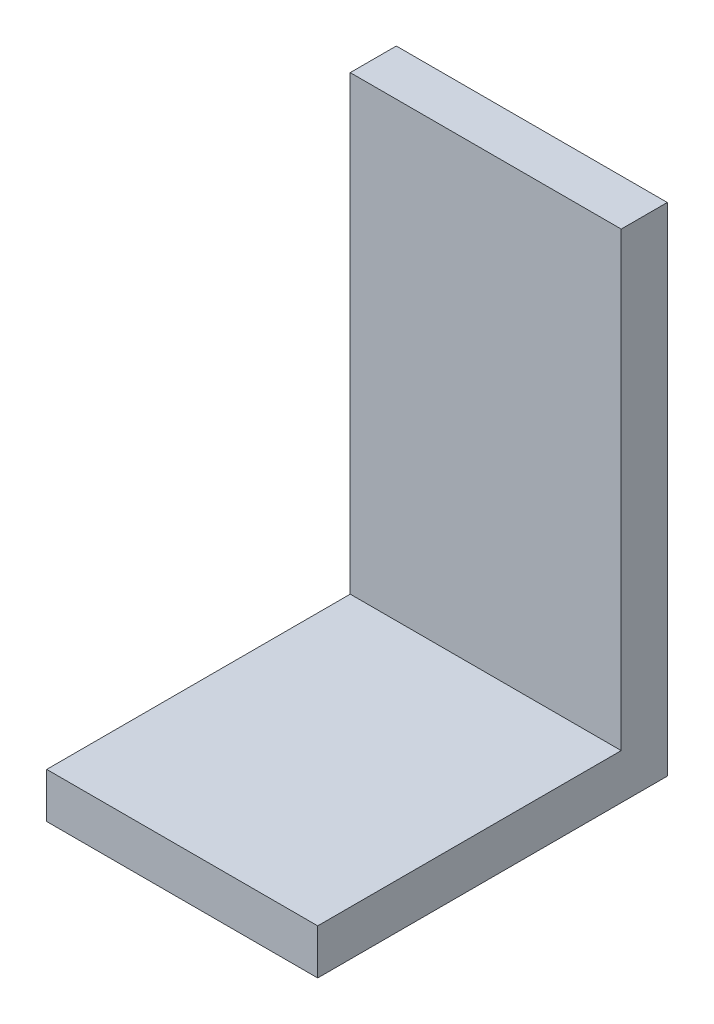
ISO-10303-21;
HEADER;
FILE_DESCRIPTION(('STEP AP214'),'2;1');
FILE_NAME('part.step','',(''),(''),'','','');
FILE_SCHEMA(('AUTOMOTIVE_DESIGN { 1 0 10303 214 1 1 1 1 }'));
ENDSEC;
DATA;
#1=APPLICATION_CONTEXT('core data for automotive mechanical design processes');
#2=APPLICATION_PROTOCOL_DEFINITION('international standard','automotive_design',2000,#1);
#3=PRODUCT_CONTEXT('',#1,'mechanical');
#4=PRODUCT('Part','Part','',(#3));
#5=PRODUCT_RELATED_PRODUCT_CATEGORY('part','',(#4));
#6=PRODUCT_DEFINITION_FORMATION('','',#4);
#7=PRODUCT_DEFINITION_CONTEXT('part definition',#1,'design');
#8=PRODUCT_DEFINITION('design','',#6,#7);
#9=PRODUCT_DEFINITION_SHAPE('','',#8);
#10=(LENGTH_UNIT() NAMED_UNIT(*) SI_UNIT(.MILLI.,.METRE.));
#11=(NAMED_UNIT(*) PLANE_ANGLE_UNIT() SI_UNIT($,.RADIAN.));
#12=(NAMED_UNIT(*) SI_UNIT($,.STERADIAN.) SOLID_ANGLE_UNIT());
#13=UNCERTAINTY_MEASURE_WITH_UNIT(LENGTH_MEASURE(1.E-05),#10,'distance_accuracy_value','');
#14=(GEOMETRIC_REPRESENTATION_CONTEXT(3) GLOBAL_UNCERTAINTY_ASSIGNED_CONTEXT((#13)) GLOBAL_UNIT_ASSIGNED_CONTEXT((#10,
#11,#12)) REPRESENTATION_CONTEXT('',''));
#15=CARTESIAN_POINT('',(0.,0.,0.));
#16=DIRECTION('',(0.,0.,1.));
#17=DIRECTION('',(1.,0.,0.));
#18=AXIS2_PLACEMENT_3D('',#15,#16,#17);
#19=CARTESIAN_POINT('',(3.9,-4.55,0.));
#20=DIRECTION('',(1.,0.,0.));
#21=DIRECTION('',(0.,0.,1.));
#22=AXIS2_PLACEMENT_3D('',#19,#20,#21);
#23=PLANE('',#22);
#24=DIRECTION('',(0.,-1.,0.));
#25=VECTOR('',#24,1.);
#26=CARTESIAN_POINT('',(3.9,-4.,0.));
#27=LINE('',#26,#25);
#28=CARTESIAN_POINT('',(3.9,-4.,0.));
#29=VERTEX_POINT('',#28);
#30=CARTESIAN_POINT('',(3.9,-4.55,0.));
#31=VERTEX_POINT('',#30);
#32=EDGE_CURVE('E11',#29,#31,#27,.T.);
#33=ORIENTED_EDGE('',*,*,#32,.F.);
#34=DIRECTION('',(0.,0.,-1.));
#35=VECTOR('',#34,1.);
#36=CARTESIAN_POINT('',(3.9,-4.,0.051));
#37=LINE('',#36,#35);
#38=CARTESIAN_POINT('',(3.9,-4.,0.051));
#39=VERTEX_POINT('',#38);
#40=EDGE_CURVE('E24',#39,#29,#37,.T.);
#41=ORIENTED_EDGE('',*,*,#40,.F.);
#42=DIRECTION('',(0.,1.,0.));
#43=VECTOR('',#42,1.);
#44=CARTESIAN_POINT('',(3.9,-4.5,0.051));
#45=LINE('',#44,#43);
#46=CARTESIAN_POINT('',(3.9,-4.5,0.051));
#47=VERTEX_POINT('',#46);
#48=EDGE_CURVE('E87',#47,#39,#45,.T.);
#49=ORIENTED_EDGE('',*,*,#48,.F.);
#50=DIRECTION('',(0.,0.,-1.));
#51=VECTOR('',#50,1.);
#52=CARTESIAN_POINT('',(3.9,-4.5,0.387));
#53=LINE('',#52,#51);
#54=CARTESIAN_POINT('',(3.9,-4.5,0.387));
#55=VERTEX_POINT('',#54);
#56=EDGE_CURVE('E114',#55,#47,#53,.T.);
#57=ORIENTED_EDGE('',*,*,#56,.F.);
#58=DIRECTION('',(0.,1.,0.));
#59=VECTOR('',#58,1.);
#60=CARTESIAN_POINT('',(3.9,-4.55,0.387));
#61=LINE('',#60,#59);
#62=CARTESIAN_POINT('',(3.9,-4.55,0.387));
#63=VERTEX_POINT('',#62);
#64=EDGE_CURVE('E111',#63,#55,#61,.T.);
#65=ORIENTED_EDGE('',*,*,#64,.F.);
#66=DIRECTION('',(0.,0.,1.));
#67=VECTOR('',#66,1.);
#68=CARTESIAN_POINT('',(3.9,-4.55,0.));
#69=LINE('',#68,#67);
#70=EDGE_CURVE('E108',#31,#63,#69,.T.);
#71=ORIENTED_EDGE('',*,*,#70,.F.);
#72=EDGE_LOOP('',(#33,#41,#49,#57,#65,#71));
#73=FACE_BOUND('',#72,.T.);
#74=ADVANCED_FACE('F17',(#73),#23,.T.);
#75=CARTESIAN_POINT('',(3.6,-4.,0.));
#76=DIRECTION('',(-1.,0.,0.));
#77=DIRECTION('',(0.,0.,1.));
#78=AXIS2_PLACEMENT_3D('',#75,#76,#77);
#79=PLANE('',#78);
#80=DIRECTION('',(0.,1.,0.));
#81=VECTOR('',#80,1.);
#82=CARTESIAN_POINT('',(3.6,-4.55,0.));
#83=LINE('',#82,#81);
#84=CARTESIAN_POINT('',(3.6,-4.55,0.));
#85=VERTEX_POINT('',#84);
#86=CARTESIAN_POINT('',(3.6,-4.,0.));
#87=VERTEX_POINT('',#86);
#88=EDGE_CURVE('E106',#85,#87,#83,.T.);
#89=ORIENTED_EDGE('',*,*,#88,.F.);
#90=DIRECTION('',(0.,0.,-1.));
#91=VECTOR('',#90,1.);
#92=CARTESIAN_POINT('',(3.6,-4.55,0.387));
#93=LINE('',#92,#91);
#94=CARTESIAN_POINT('',(3.6,-4.55,0.387));
#95=VERTEX_POINT('',#94);
#96=EDGE_CURVE('E103',#95,#85,#93,.T.);
#97=ORIENTED_EDGE('',*,*,#96,.F.);
#98=DIRECTION('',(0.,-1.,0.));
#99=VECTOR('',#98,1.);
#100=CARTESIAN_POINT('',(3.6,-4.5,0.387));
#101=LINE('',#100,#99);
#102=CARTESIAN_POINT('',(3.6,-4.5,0.387));
#103=VERTEX_POINT('',#102);
#104=EDGE_CURVE('E100',#103,#95,#101,.T.);
#105=ORIENTED_EDGE('',*,*,#104,.F.);
#106=DIRECTION('',(0.,0.,1.));
#107=VECTOR('',#106,1.);
#108=CARTESIAN_POINT('',(3.6,-4.5,0.051));
#109=LINE('',#108,#107);
#110=CARTESIAN_POINT('',(3.6,-4.5,0.051));
#111=VERTEX_POINT('',#110);
#112=EDGE_CURVE('E72',#111,#103,#109,.T.);
#113=ORIENTED_EDGE('',*,*,#112,.F.);
#114=DIRECTION('',(0.,-1.,0.));
#115=VECTOR('',#114,1.);
#116=CARTESIAN_POINT('',(3.6,-4.,0.051));
#117=LINE('',#116,#115);
#118=CARTESIAN_POINT('',(3.6,-4.,0.051));
#119=VERTEX_POINT('',#118);
#120=EDGE_CURVE('E66',#119,#111,#117,.T.);
#121=ORIENTED_EDGE('',*,*,#120,.F.);
#122=DIRECTION('',(0.,0.,1.));
#123=VECTOR('',#122,1.);
#124=CARTESIAN_POINT('',(3.6,-4.,0.));
#125=LINE('',#124,#123);
#126=EDGE_CURVE('E69',#87,#119,#125,.T.);
#127=ORIENTED_EDGE('',*,*,#126,.F.);
#128=EDGE_LOOP('',(#89,#97,#105,#113,#121,#127));
#129=FACE_BOUND('',#128,.T.);
#130=ADVANCED_FACE('F68',(#129),#79,.T.);
#131=CARTESIAN_POINT('',(3.9,-4.55,0.387));
#132=DIRECTION('',(0.,0.,1.));
#133=DIRECTION('',(0.,1.,0.));
#134=AXIS2_PLACEMENT_3D('',#131,#132,#133);
#135=PLANE('',#134);
#136=ORIENTED_EDGE('',*,*,#64,.T.);
#137=DIRECTION('',(1.,0.,0.));
#138=VECTOR('',#137,1.);
#139=CARTESIAN_POINT('',(3.6,-4.5,0.387));
#140=LINE('',#139,#138);
#141=EDGE_CURVE('E83',#103,#55,#140,.T.);
#142=ORIENTED_EDGE('',*,*,#141,.F.);
#143=ORIENTED_EDGE('',*,*,#104,.T.);
#144=DIRECTION('',(-1.,0.,0.));
#145=VECTOR('',#144,1.);
#146=CARTESIAN_POINT('',(3.9,-4.55,0.387));
#147=LINE('',#146,#145);
#148=EDGE_CURVE('E88',#63,#95,#147,.T.);
#149=ORIENTED_EDGE('',*,*,#148,.F.);
#150=EDGE_LOOP('',(#136,#142,#143,#149));
#151=FACE_BOUND('',#150,.T.);
#152=ADVANCED_FACE('F125',(#151),#135,.T.);
#153=CARTESIAN_POINT('',(3.9,-4.5,0.051));
#154=DIRECTION('',(0.,0.,1.));
#155=DIRECTION('',(0.,1.,0.));
#156=AXIS2_PLACEMENT_3D('',#153,#154,#155);
#157=PLANE('',#156);
#158=ORIENTED_EDGE('',*,*,#48,.T.);
#159=DIRECTION('',(1.,0.,0.));
#160=VECTOR('',#159,1.);
#161=CARTESIAN_POINT('',(3.6,-4.,0.051));
#162=LINE('',#161,#160);
#163=EDGE_CURVE('E81',#119,#39,#162,.T.);
#164=ORIENTED_EDGE('',*,*,#163,.F.);
#165=ORIENTED_EDGE('',*,*,#120,.T.);
#166=DIRECTION('',(-1.,0.,0.));
#167=VECTOR('',#166,1.);
#168=CARTESIAN_POINT('',(3.9,-4.5,0.051));
#169=LINE('',#168,#167);
#170=EDGE_CURVE('E89',#47,#111,#169,.T.);
#171=ORIENTED_EDGE('',*,*,#170,.F.);
#172=EDGE_LOOP('',(#158,#164,#165,#171));
#173=FACE_BOUND('',#172,.T.);
#174=ADVANCED_FACE('F86',(#173),#157,.T.);
#175=CARTESIAN_POINT('',(3.6,-4.55,0.));
#176=DIRECTION('',(0.,-1.,0.));
#177=DIRECTION('',(0.,0.,1.));
#178=AXIS2_PLACEMENT_3D('',#175,#176,#177);
#179=PLANE('',#178);
#180=DIRECTION('',(-1.,0.,0.));
#181=VECTOR('',#180,1.);
#182=CARTESIAN_POINT('',(3.9,-4.55,0.));
#183=LINE('',#182,#181);
#184=EDGE_CURVE('E93',#31,#85,#183,.T.);
#185=ORIENTED_EDGE('',*,*,#184,.F.);
#186=ORIENTED_EDGE('',*,*,#70,.T.);
#187=ORIENTED_EDGE('',*,*,#148,.T.);
#188=ORIENTED_EDGE('',*,*,#96,.T.);
#189=EDGE_LOOP('',(#185,#186,#187,#188));
#190=FACE_BOUND('',#189,.T.);
#191=ADVANCED_FACE('F121',(#190),#179,.T.);
#192=CARTESIAN_POINT('',(3.9,-4.,0.));
#193=DIRECTION('',(0.,1.,0.));
#194=DIRECTION('',(0.,0.,1.));
#195=AXIS2_PLACEMENT_3D('',#192,#193,#194);
#196=PLANE('',#195);
#197=DIRECTION('',(1.,0.,0.));
#198=VECTOR('',#197,1.);
#199=CARTESIAN_POINT('',(3.6,-4.,0.));
#200=LINE('',#199,#198);
#201=EDGE_CURVE('E82',#87,#29,#200,.T.);
#202=ORIENTED_EDGE('',*,*,#201,.F.);
#203=ORIENTED_EDGE('',*,*,#126,.T.);
#204=ORIENTED_EDGE('',*,*,#163,.T.);
#205=ORIENTED_EDGE('',*,*,#40,.T.);
#206=EDGE_LOOP('',(#202,#203,#204,#205));
#207=FACE_BOUND('',#206,.T.);
#208=ADVANCED_FACE('F80',(#207),#196,.T.);
#209=CARTESIAN_POINT('',(3.9,-4.5,0.051));
#210=DIRECTION('',(0.,1.,0.));
#211=DIRECTION('',(0.,0.,1.));
#212=AXIS2_PLACEMENT_3D('',#209,#210,#211);
#213=PLANE('',#212);
#214=ORIENTED_EDGE('',*,*,#170,.T.);
#215=ORIENTED_EDGE('',*,*,#112,.T.);
#216=ORIENTED_EDGE('',*,*,#141,.T.);
#217=ORIENTED_EDGE('',*,*,#56,.T.);
#218=EDGE_LOOP('',(#214,#215,#216,#217));
#219=FACE_BOUND('',#218,.T.);
#220=ADVANCED_FACE('F127',(#219),#213,.T.);
#221=CARTESIAN_POINT('',(3.6,-4.55,0.));
#222=DIRECTION('',(0.,0.,-1.));
#223=DIRECTION('',(0.,1.,0.));
#224=AXIS2_PLACEMENT_3D('',#221,#222,#223);
#225=PLANE('',#224);
#226=ORIENTED_EDGE('',*,*,#88,.T.);
#227=ORIENTED_EDGE('',*,*,#201,.T.);
#228=ORIENTED_EDGE('',*,*,#32,.T.);
#229=ORIENTED_EDGE('',*,*,#184,.T.);
#230=EDGE_LOOP('',(#226,#227,#228,#229));
#231=FACE_BOUND('',#230,.T.);
#232=ADVANCED_FACE('F117',(#231),#225,.T.);
#233=CLOSED_SHELL('',(#74,#130,#152,#174,#191,#208,#220,#232));
#234=MANIFOLD_SOLID_BREP('B1',#233);
#235=ADVANCED_BREP_SHAPE_REPRESENTATION('',(#18,#234),#14);
#236=SHAPE_DEFINITION_REPRESENTATION(#9,#235);
ENDSEC;
END-ISO-10303-21;
